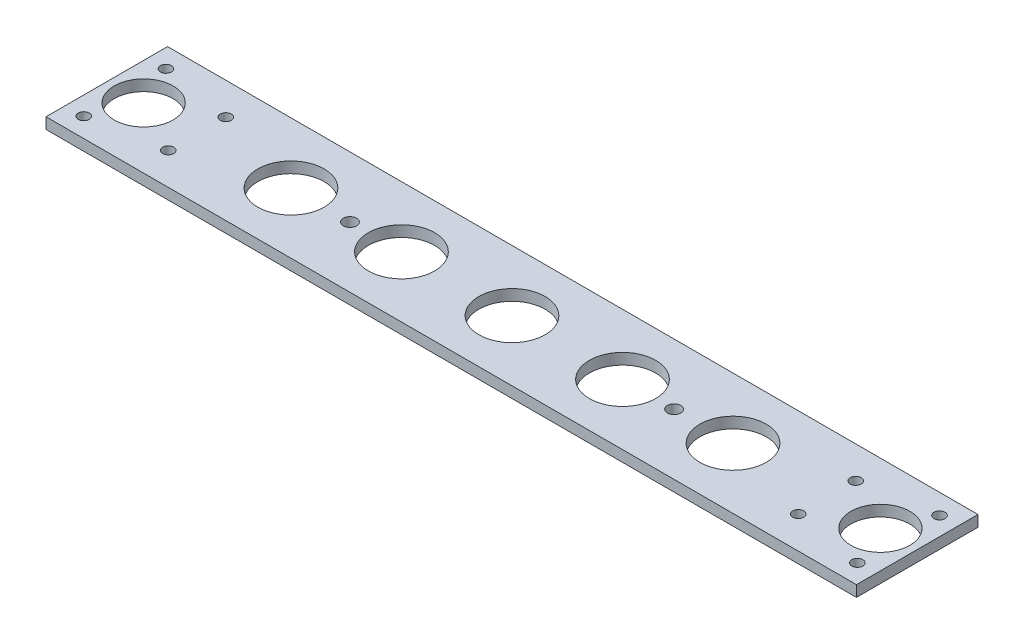
ISO-10303-21;
HEADER;
FILE_DESCRIPTION(('STEP AP214'),'2;1');
FILE_NAME('part.step','',(''),(''),'','','');
FILE_SCHEMA(('AUTOMOTIVE_DESIGN { 1 0 10303 214 1 1 1 1 }'));
ENDSEC;
DATA;
#1=APPLICATION_CONTEXT('core data for automotive mechanical design processes');
#2=APPLICATION_PROTOCOL_DEFINITION('international standard','automotive_design',2000,#1);
#3=PRODUCT_CONTEXT('',#1,'mechanical');
#4=PRODUCT('Part','Part','',(#3));
#5=PRODUCT_RELATED_PRODUCT_CATEGORY('part','',(#4));
#6=PRODUCT_DEFINITION_FORMATION('','',#4);
#7=PRODUCT_DEFINITION_CONTEXT('part definition',#1,'design');
#8=PRODUCT_DEFINITION('design','',#6,#7);
#9=PRODUCT_DEFINITION_SHAPE('','',#8);
#10=(LENGTH_UNIT() NAMED_UNIT(*) SI_UNIT(.MILLI.,.METRE.));
#11=(NAMED_UNIT(*) PLANE_ANGLE_UNIT() SI_UNIT($,.RADIAN.));
#12=(NAMED_UNIT(*) SI_UNIT($,.STERADIAN.) SOLID_ANGLE_UNIT());
#13=UNCERTAINTY_MEASURE_WITH_UNIT(LENGTH_MEASURE(1.E-05),#10,'distance_accuracy_value','');
#14=(GEOMETRIC_REPRESENTATION_CONTEXT(3) GLOBAL_UNCERTAINTY_ASSIGNED_CONTEXT((#13)) GLOBAL_UNIT_ASSIGNED_CONTEXT((#10,
#11,#12)) REPRESENTATION_CONTEXT('',''));
#15=CARTESIAN_POINT('',(0.,0.,0.));
#16=DIRECTION('',(0.,0.,1.));
#17=DIRECTION('',(1.,0.,0.));
#18=AXIS2_PLACEMENT_3D('',#15,#16,#17);
#19=CARTESIAN_POINT('',(0.,3.,0.));
#20=DIRECTION('',(0.,1.,0.));
#21=DIRECTION('',(0.,0.,1.));
#22=AXIS2_PLACEMENT_3D('',#19,#20,#21);
#23=PLANE('',#22);
#24=CARTESIAN_POINT('',(50.,3.,16.5));
#25=DIRECTION('',(0.,1.,0.));
#26=DIRECTION('',(0.,0.,1.));
#27=AXIS2_PLACEMENT_3D('',#24,#25,#26);
#28=CIRCLE('',#27,9.);
#29=CARTESIAN_POINT('',(50.,3.,25.5));
#30=VERTEX_POINT('',#29);
#31=EDGE_CURVE('E200',#30,#30,#28,.T.);
#32=ORIENTED_EDGE('',*,*,#31,.F.);
#33=EDGE_LOOP('',(#32));
#34=FACE_BOUND('',#33,.T.);
#35=CARTESIAN_POINT('',(170.,3.,16.5));
#36=DIRECTION('',(0.,1.,0.));
#37=DIRECTION('',(0.,0.,1.));
#38=AXIS2_PLACEMENT_3D('',#35,#36,#37);
#39=CIRCLE('',#38,9.00000000000001);
#40=CARTESIAN_POINT('',(170.,3.,25.5));
#41=VERTEX_POINT('',#40);
#42=EDGE_CURVE('E188',#41,#41,#39,.T.);
#43=ORIENTED_EDGE('',*,*,#42,.F.);
#44=EDGE_LOOP('',(#43));
#45=FACE_BOUND('',#44,.T.);
#46=CARTESIAN_POINT('',(210.,3.,16.5));
#47=DIRECTION('',(0.,1.,0.));
#48=DIRECTION('',(0.,0.,1.));
#49=AXIS2_PLACEMENT_3D('',#46,#47,#48);
#50=CIRCLE('',#49,8.00000000000001);
#51=CARTESIAN_POINT('',(210.,3.,24.5));
#52=VERTEX_POINT('',#51);
#53=EDGE_CURVE('E176',#52,#52,#50,.T.);
#54=ORIENTED_EDGE('',*,*,#53,.F.);
#55=EDGE_LOOP('',(#54));
#56=FACE_BOUND('',#55,.T.);
#57=CARTESIAN_POINT('',(140.,3.,16.5));
#58=DIRECTION('',(0.,1.,0.));
#59=DIRECTION('',(0.,0.,1.));
#60=AXIS2_PLACEMENT_3D('',#57,#58,#59);
#61=CIRCLE('',#60,9.00000000000001);
#62=CARTESIAN_POINT('',(140.,3.,25.5));
#63=VERTEX_POINT('',#62);
#64=EDGE_CURVE('E164',#63,#63,#61,.T.);
#65=ORIENTED_EDGE('',*,*,#64,.F.);
#66=EDGE_LOOP('',(#65));
#67=FACE_BOUND('',#66,.T.);
#68=CARTESIAN_POINT('',(215.,3.,27.75));
#69=DIRECTION('',(0.,1.,0.));
#70=DIRECTION('',(0.,0.,1.));
#71=AXIS2_PLACEMENT_3D('',#68,#69,#70);
#72=CIRCLE('',#71,1.5);
#73=CARTESIAN_POINT('',(215.,3.,29.25));
#74=VERTEX_POINT('',#73);
#75=EDGE_CURVE('E152',#74,#74,#72,.T.);
#76=ORIENTED_EDGE('',*,*,#75,.F.);
#77=EDGE_LOOP('',(#76));
#78=FACE_BOUND('',#77,.T.);
#79=CARTESIAN_POINT('',(195.5,3.,8.7));
#80=DIRECTION('',(0.,1.,0.));
#81=DIRECTION('',(0.,0.,1.));
#82=AXIS2_PLACEMENT_3D('',#79,#80,#81);
#83=CIRCLE('',#82,1.5);
#84=CARTESIAN_POINT('',(195.5,3.,10.2));
#85=VERTEX_POINT('',#84);
#86=EDGE_CURVE('E140',#85,#85,#83,.T.);
#87=ORIENTED_EDGE('',*,*,#86,.F.);
#88=EDGE_LOOP('',(#87));
#89=FACE_BOUND('',#88,.T.);
#90=CARTESIAN_POINT('',(24.5,3.,24.3));
#91=DIRECTION('',(0.,1.,0.));
#92=DIRECTION('',(0.,0.,1.));
#93=AXIS2_PLACEMENT_3D('',#90,#91,#92);
#94=CIRCLE('',#93,1.5);
#95=CARTESIAN_POINT('',(24.5,3.,25.8));
#96=VERTEX_POINT('',#95);
#97=EDGE_CURVE('E128',#96,#96,#94,.T.);
#98=ORIENTED_EDGE('',*,*,#97,.F.);
#99=EDGE_LOOP('',(#98));
#100=FACE_BOUND('',#99,.T.);
#101=CARTESIAN_POINT('',(5.,3.,5.45));
#102=DIRECTION('',(0.,1.,0.));
#103=DIRECTION('',(0.,0.,1.));
#104=AXIS2_PLACEMENT_3D('',#101,#102,#103);
#105=CIRCLE('',#104,1.5);
#106=CARTESIAN_POINT('',(5.,3.,6.95));
#107=VERTEX_POINT('',#106);
#108=EDGE_CURVE('E116',#107,#107,#105,.T.);
#109=ORIENTED_EDGE('',*,*,#108,.F.);
#110=EDGE_LOOP('',(#109));
#111=FACE_BOUND('',#110,.T.);
#112=DIRECTION('',(0.,0.,1.));
#113=VECTOR('',#112,1.);
#114=CARTESIAN_POINT('',(0.,3.,0.));
#115=LINE('',#114,#113);
#116=CARTESIAN_POINT('',(0.,3.,0.));
#117=VERTEX_POINT('',#116);
#118=CARTESIAN_POINT('',(0.,3.,33.));
#119=VERTEX_POINT('',#118);
#120=EDGE_CURVE('E86',#117,#119,#115,.T.);
#121=ORIENTED_EDGE('',*,*,#120,.T.);
#122=DIRECTION('',(1.,0.,0.));
#123=VECTOR('',#122,1.);
#124=CARTESIAN_POINT('',(0.,3.,33.));
#125=LINE('',#124,#123);
#126=CARTESIAN_POINT('',(220.,3.,33.));
#127=VERTEX_POINT('',#126);
#128=EDGE_CURVE('E81',#119,#127,#125,.T.);
#129=ORIENTED_EDGE('',*,*,#128,.T.);
#130=DIRECTION('',(0.,0.,-1.));
#131=VECTOR('',#130,1.);
#132=CARTESIAN_POINT('',(220.,3.,0.));
#133=LINE('',#132,#131);
#134=CARTESIAN_POINT('',(220.,3.,0.));
#135=VERTEX_POINT('',#134);
#136=EDGE_CURVE('E84',#127,#135,#133,.T.);
#137=ORIENTED_EDGE('',*,*,#136,.T.);
#138=DIRECTION('',(-1.,0.,0.));
#139=VECTOR('',#138,1.);
#140=CARTESIAN_POINT('',(0.,3.,0.));
#141=LINE('',#140,#139);
#142=EDGE_CURVE('E51',#135,#117,#141,.T.);
#143=ORIENTED_EDGE('',*,*,#142,.T.);
#144=EDGE_LOOP('',(#121,#129,#137,#143));
#145=FACE_BOUND('',#144,.T.);
#146=CARTESIAN_POINT('',(5.,3.,27.75));
#147=DIRECTION('',(0.,1.,0.));
#148=DIRECTION('',(0.,0.,1.));
#149=AXIS2_PLACEMENT_3D('',#146,#147,#148);
#150=CIRCLE('',#149,1.5);
#151=CARTESIAN_POINT('',(5.,3.,29.25));
#152=VERTEX_POINT('',#151);
#153=EDGE_CURVE('E101',#152,#152,#150,.T.);
#154=ORIENTED_EDGE('',*,*,#153,.F.);
#155=EDGE_LOOP('',(#154));
#156=FACE_BOUND('',#155,.T.);
#157=CARTESIAN_POINT('',(24.5,3.,8.7));
#158=DIRECTION('',(0.,1.,0.));
#159=DIRECTION('',(0.,0.,1.));
#160=AXIS2_PLACEMENT_3D('',#157,#158,#159);
#161=CIRCLE('',#160,1.5);
#162=CARTESIAN_POINT('',(24.5,3.,10.2));
#163=VERTEX_POINT('',#162);
#164=EDGE_CURVE('E122',#163,#163,#161,.T.);
#165=ORIENTED_EDGE('',*,*,#164,.F.);
#166=EDGE_LOOP('',(#165));
#167=FACE_BOUND('',#166,.T.);
#168=CARTESIAN_POINT('',(110.,3.,16.5));
#169=DIRECTION('',(0.,1.,0.));
#170=DIRECTION('',(0.,0.,1.));
#171=AXIS2_PLACEMENT_3D('',#168,#169,#170);
#172=CIRCLE('',#171,9.);
#173=CARTESIAN_POINT('',(110.,3.,25.5));
#174=VERTEX_POINT('',#173);
#175=EDGE_CURVE('E134',#174,#174,#172,.T.);
#176=ORIENTED_EDGE('',*,*,#175,.F.);
#177=EDGE_LOOP('',(#176));
#178=FACE_BOUND('',#177,.T.);
#179=CARTESIAN_POINT('',(195.5,3.,24.3));
#180=DIRECTION('',(0.,1.,0.));
#181=DIRECTION('',(0.,0.,1.));
#182=AXIS2_PLACEMENT_3D('',#179,#180,#181);
#183=CIRCLE('',#182,1.5);
#184=CARTESIAN_POINT('',(195.5,3.,25.8));
#185=VERTEX_POINT('',#184);
#186=EDGE_CURVE('E146',#185,#185,#183,.T.);
#187=ORIENTED_EDGE('',*,*,#186,.F.);
#188=EDGE_LOOP('',(#187));
#189=FACE_BOUND('',#188,.T.);
#190=CARTESIAN_POINT('',(215.,3.,5.45));
#191=DIRECTION('',(0.,1.,0.));
#192=DIRECTION('',(0.,0.,1.));
#193=AXIS2_PLACEMENT_3D('',#190,#191,#192);
#194=CIRCLE('',#193,1.5);
#195=CARTESIAN_POINT('',(215.,3.,6.95));
#196=VERTEX_POINT('',#195);
#197=EDGE_CURVE('E158',#196,#196,#194,.T.);
#198=ORIENTED_EDGE('',*,*,#197,.F.);
#199=EDGE_LOOP('',(#198));
#200=FACE_BOUND('',#199,.T.);
#201=CARTESIAN_POINT('',(10.,3.,16.5));
#202=DIRECTION('',(0.,1.,0.));
#203=DIRECTION('',(0.,0.,1.));
#204=AXIS2_PLACEMENT_3D('',#201,#202,#203);
#205=CIRCLE('',#204,8.);
#206=CARTESIAN_POINT('',(10.,3.,24.5));
#207=VERTEX_POINT('',#206);
#208=EDGE_CURVE('E170',#207,#207,#205,.T.);
#209=ORIENTED_EDGE('',*,*,#208,.F.);
#210=EDGE_LOOP('',(#209));
#211=FACE_BOUND('',#210,.T.);
#212=CARTESIAN_POINT('',(154.,3.,16.5));
#213=DIRECTION('',(0.,1.,0.));
#214=DIRECTION('',(0.,0.,1.));
#215=AXIS2_PLACEMENT_3D('',#212,#213,#214);
#216=CIRCLE('',#215,1.80000000000001);
#217=CARTESIAN_POINT('',(154.,3.,18.3));
#218=VERTEX_POINT('',#217);
#219=EDGE_CURVE('E182',#218,#218,#216,.T.);
#220=ORIENTED_EDGE('',*,*,#219,.F.);
#221=EDGE_LOOP('',(#220));
#222=FACE_BOUND('',#221,.T.);
#223=CARTESIAN_POINT('',(80.,3.,16.5));
#224=DIRECTION('',(0.,1.,0.));
#225=DIRECTION('',(0.,0.,1.));
#226=AXIS2_PLACEMENT_3D('',#223,#224,#225);
#227=CIRCLE('',#226,9.);
#228=CARTESIAN_POINT('',(80.,3.,25.5));
#229=VERTEX_POINT('',#228);
#230=EDGE_CURVE('E194',#229,#229,#227,.T.);
#231=ORIENTED_EDGE('',*,*,#230,.F.);
#232=EDGE_LOOP('',(#231));
#233=FACE_BOUND('',#232,.T.);
#234=CARTESIAN_POINT('',(66.,3.,16.5));
#235=DIRECTION('',(0.,1.,0.));
#236=DIRECTION('',(0.,0.,1.));
#237=AXIS2_PLACEMENT_3D('',#234,#235,#236);
#238=CIRCLE('',#237,1.79999999999999);
#239=CARTESIAN_POINT('',(66.,3.,18.3));
#240=VERTEX_POINT('',#239);
#241=EDGE_CURVE('E206',#240,#240,#238,.T.);
#242=ORIENTED_EDGE('',*,*,#241,.F.);
#243=EDGE_LOOP('',(#242));
#244=FACE_BOUND('',#243,.T.);
#245=ADVANCED_FACE('F34',(#34,#45,#56,#67,#78,#89,#100,#111,#145,#156,#167,#178,#189,#200,#211,
#222,#233,#244),#23,.T.);
#246=CARTESIAN_POINT('',(0.,0.,0.));
#247=DIRECTION('',(0.,1.,0.));
#248=DIRECTION('',(0.,0.,1.));
#249=AXIS2_PLACEMENT_3D('',#246,#247,#248);
#250=PLANE('',#249);
#251=DIRECTION('',(0.,0.,1.));
#252=VECTOR('',#251,1.);
#253=CARTESIAN_POINT('',(0.,0.,0.));
#254=LINE('',#253,#252);
#255=CARTESIAN_POINT('',(0.,0.,0.));
#256=VERTEX_POINT('',#255);
#257=CARTESIAN_POINT('',(0.,0.,33.));
#258=VERTEX_POINT('',#257);
#259=EDGE_CURVE('E98',#256,#258,#254,.T.);
#260=ORIENTED_EDGE('',*,*,#259,.F.);
#261=DIRECTION('',(-1.,0.,0.));
#262=VECTOR('',#261,1.);
#263=CARTESIAN_POINT('',(0.,0.,0.));
#264=LINE('',#263,#262);
#265=CARTESIAN_POINT('',(220.,0.,0.));
#266=VERTEX_POINT('',#265);
#267=EDGE_CURVE('E74',#266,#256,#264,.T.);
#268=ORIENTED_EDGE('',*,*,#267,.F.);
#269=DIRECTION('',(0.,0.,-1.));
#270=VECTOR('',#269,1.);
#271=CARTESIAN_POINT('',(220.,0.,0.));
#272=LINE('',#271,#270);
#273=CARTESIAN_POINT('',(220.,0.,33.));
#274=VERTEX_POINT('',#273);
#275=EDGE_CURVE('E68',#274,#266,#272,.T.);
#276=ORIENTED_EDGE('',*,*,#275,.F.);
#277=DIRECTION('',(1.,0.,0.));
#278=VECTOR('',#277,1.);
#279=CARTESIAN_POINT('',(0.,0.,33.));
#280=LINE('',#279,#278);
#281=EDGE_CURVE('E90',#258,#274,#280,.T.);
#282=ORIENTED_EDGE('',*,*,#281,.F.);
#283=EDGE_LOOP('',(#260,#268,#276,#282));
#284=FACE_BOUND('',#283,.T.);
#285=CARTESIAN_POINT('',(5.,0.,27.75));
#286=DIRECTION('',(0.,1.,0.));
#287=DIRECTION('',(0.,0.,1.));
#288=AXIS2_PLACEMENT_3D('',#285,#286,#287);
#289=CIRCLE('',#288,1.5);
#290=CARTESIAN_POINT('',(5.,0.,29.25));
#291=VERTEX_POINT('',#290);
#292=EDGE_CURVE('E113',#291,#291,#289,.T.);
#293=ORIENTED_EDGE('',*,*,#292,.T.);
#294=EDGE_LOOP('',(#293));
#295=FACE_BOUND('',#294,.T.);
#296=CARTESIAN_POINT('',(5.,0.,5.45));
#297=DIRECTION('',(0.,1.,0.));
#298=DIRECTION('',(0.,0.,1.));
#299=AXIS2_PLACEMENT_3D('',#296,#297,#298);
#300=CIRCLE('',#299,1.5);
#301=CARTESIAN_POINT('',(5.,0.,6.95));
#302=VERTEX_POINT('',#301);
#303=EDGE_CURVE('E119',#302,#302,#300,.T.);
#304=ORIENTED_EDGE('',*,*,#303,.T.);
#305=EDGE_LOOP('',(#304));
#306=FACE_BOUND('',#305,.T.);
#307=CARTESIAN_POINT('',(24.5,0.,8.7));
#308=DIRECTION('',(0.,1.,0.));
#309=DIRECTION('',(0.,0.,1.));
#310=AXIS2_PLACEMENT_3D('',#307,#308,#309);
#311=CIRCLE('',#310,1.5);
#312=CARTESIAN_POINT('',(24.5,0.,10.2));
#313=VERTEX_POINT('',#312);
#314=EDGE_CURVE('E125',#313,#313,#311,.T.);
#315=ORIENTED_EDGE('',*,*,#314,.T.);
#316=EDGE_LOOP('',(#315));
#317=FACE_BOUND('',#316,.T.);
#318=CARTESIAN_POINT('',(24.5,0.,24.3));
#319=DIRECTION('',(0.,1.,0.));
#320=DIRECTION('',(0.,0.,1.));
#321=AXIS2_PLACEMENT_3D('',#318,#319,#320);
#322=CIRCLE('',#321,1.5);
#323=CARTESIAN_POINT('',(24.5,0.,25.8));
#324=VERTEX_POINT('',#323);
#325=EDGE_CURVE('E131',#324,#324,#322,.T.);
#326=ORIENTED_EDGE('',*,*,#325,.T.);
#327=EDGE_LOOP('',(#326));
#328=FACE_BOUND('',#327,.T.);
#329=CARTESIAN_POINT('',(110.,0.,16.5));
#330=DIRECTION('',(0.,1.,0.));
#331=DIRECTION('',(0.,0.,1.));
#332=AXIS2_PLACEMENT_3D('',#329,#330,#331);
#333=CIRCLE('',#332,9.);
#334=CARTESIAN_POINT('',(110.,0.,25.5));
#335=VERTEX_POINT('',#334);
#336=EDGE_CURVE('E137',#335,#335,#333,.T.);
#337=ORIENTED_EDGE('',*,*,#336,.T.);
#338=EDGE_LOOP('',(#337));
#339=FACE_BOUND('',#338,.T.);
#340=CARTESIAN_POINT('',(195.5,0.,8.7));
#341=DIRECTION('',(0.,1.,0.));
#342=DIRECTION('',(0.,0.,1.));
#343=AXIS2_PLACEMENT_3D('',#340,#341,#342);
#344=CIRCLE('',#343,1.5);
#345=CARTESIAN_POINT('',(195.5,0.,10.2));
#346=VERTEX_POINT('',#345);
#347=EDGE_CURVE('E143',#346,#346,#344,.T.);
#348=ORIENTED_EDGE('',*,*,#347,.T.);
#349=EDGE_LOOP('',(#348));
#350=FACE_BOUND('',#349,.T.);
#351=CARTESIAN_POINT('',(195.5,0.,24.3));
#352=DIRECTION('',(0.,1.,0.));
#353=DIRECTION('',(0.,0.,1.));
#354=AXIS2_PLACEMENT_3D('',#351,#352,#353);
#355=CIRCLE('',#354,1.5);
#356=CARTESIAN_POINT('',(195.5,0.,25.8));
#357=VERTEX_POINT('',#356);
#358=EDGE_CURVE('E149',#357,#357,#355,.T.);
#359=ORIENTED_EDGE('',*,*,#358,.T.);
#360=EDGE_LOOP('',(#359));
#361=FACE_BOUND('',#360,.T.);
#362=CARTESIAN_POINT('',(215.,0.,27.75));
#363=DIRECTION('',(0.,1.,0.));
#364=DIRECTION('',(0.,0.,1.));
#365=AXIS2_PLACEMENT_3D('',#362,#363,#364);
#366=CIRCLE('',#365,1.5);
#367=CARTESIAN_POINT('',(215.,0.,29.25));
#368=VERTEX_POINT('',#367);
#369=EDGE_CURVE('E155',#368,#368,#366,.T.);
#370=ORIENTED_EDGE('',*,*,#369,.T.);
#371=EDGE_LOOP('',(#370));
#372=FACE_BOUND('',#371,.T.);
#373=CARTESIAN_POINT('',(215.,0.,5.45));
#374=DIRECTION('',(0.,1.,0.));
#375=DIRECTION('',(0.,0.,1.));
#376=AXIS2_PLACEMENT_3D('',#373,#374,#375);
#377=CIRCLE('',#376,1.5);
#378=CARTESIAN_POINT('',(215.,0.,6.95));
#379=VERTEX_POINT('',#378);
#380=EDGE_CURVE('E161',#379,#379,#377,.T.);
#381=ORIENTED_EDGE('',*,*,#380,.T.);
#382=EDGE_LOOP('',(#381));
#383=FACE_BOUND('',#382,.T.);
#384=CARTESIAN_POINT('',(140.,0.,16.5));
#385=DIRECTION('',(0.,1.,0.));
#386=DIRECTION('',(0.,0.,1.));
#387=AXIS2_PLACEMENT_3D('',#384,#385,#386);
#388=CIRCLE('',#387,9.00000000000001);
#389=CARTESIAN_POINT('',(140.,0.,25.5));
#390=VERTEX_POINT('',#389);
#391=EDGE_CURVE('E167',#390,#390,#388,.T.);
#392=ORIENTED_EDGE('',*,*,#391,.T.);
#393=EDGE_LOOP('',(#392));
#394=FACE_BOUND('',#393,.T.);
#395=CARTESIAN_POINT('',(10.,0.,16.5));
#396=DIRECTION('',(0.,1.,0.));
#397=DIRECTION('',(0.,0.,1.));
#398=AXIS2_PLACEMENT_3D('',#395,#396,#397);
#399=CIRCLE('',#398,8.);
#400=CARTESIAN_POINT('',(10.,0.,24.5));
#401=VERTEX_POINT('',#400);
#402=EDGE_CURVE('E173',#401,#401,#399,.T.);
#403=ORIENTED_EDGE('',*,*,#402,.T.);
#404=EDGE_LOOP('',(#403));
#405=FACE_BOUND('',#404,.T.);
#406=CARTESIAN_POINT('',(210.,0.,16.5));
#407=DIRECTION('',(0.,1.,0.));
#408=DIRECTION('',(0.,0.,1.));
#409=AXIS2_PLACEMENT_3D('',#406,#407,#408);
#410=CIRCLE('',#409,8.00000000000001);
#411=CARTESIAN_POINT('',(210.,0.,24.5));
#412=VERTEX_POINT('',#411);
#413=EDGE_CURVE('E179',#412,#412,#410,.T.);
#414=ORIENTED_EDGE('',*,*,#413,.T.);
#415=EDGE_LOOP('',(#414));
#416=FACE_BOUND('',#415,.T.);
#417=CARTESIAN_POINT('',(154.,0.,16.5));
#418=DIRECTION('',(0.,1.,0.));
#419=DIRECTION('',(0.,0.,1.));
#420=AXIS2_PLACEMENT_3D('',#417,#418,#419);
#421=CIRCLE('',#420,1.80000000000001);
#422=CARTESIAN_POINT('',(154.,0.,18.3));
#423=VERTEX_POINT('',#422);
#424=EDGE_CURVE('E185',#423,#423,#421,.T.);
#425=ORIENTED_EDGE('',*,*,#424,.T.);
#426=EDGE_LOOP('',(#425));
#427=FACE_BOUND('',#426,.T.);
#428=CARTESIAN_POINT('',(170.,0.,16.5));
#429=DIRECTION('',(0.,1.,0.));
#430=DIRECTION('',(0.,0.,1.));
#431=AXIS2_PLACEMENT_3D('',#428,#429,#430);
#432=CIRCLE('',#431,9.00000000000001);
#433=CARTESIAN_POINT('',(170.,0.,25.5));
#434=VERTEX_POINT('',#433);
#435=EDGE_CURVE('E191',#434,#434,#432,.T.);
#436=ORIENTED_EDGE('',*,*,#435,.T.);
#437=EDGE_LOOP('',(#436));
#438=FACE_BOUND('',#437,.T.);
#439=CARTESIAN_POINT('',(80.,0.,16.5));
#440=DIRECTION('',(0.,1.,0.));
#441=DIRECTION('',(0.,0.,1.));
#442=AXIS2_PLACEMENT_3D('',#439,#440,#441);
#443=CIRCLE('',#442,9.);
#444=CARTESIAN_POINT('',(80.,0.,25.5));
#445=VERTEX_POINT('',#444);
#446=EDGE_CURVE('E197',#445,#445,#443,.T.);
#447=ORIENTED_EDGE('',*,*,#446,.T.);
#448=EDGE_LOOP('',(#447));
#449=FACE_BOUND('',#448,.T.);
#450=CARTESIAN_POINT('',(50.,0.,16.5));
#451=DIRECTION('',(0.,1.,0.));
#452=DIRECTION('',(0.,0.,1.));
#453=AXIS2_PLACEMENT_3D('',#450,#451,#452);
#454=CIRCLE('',#453,9.);
#455=CARTESIAN_POINT('',(50.,0.,25.5));
#456=VERTEX_POINT('',#455);
#457=EDGE_CURVE('E203',#456,#456,#454,.T.);
#458=ORIENTED_EDGE('',*,*,#457,.T.);
#459=EDGE_LOOP('',(#458));
#460=FACE_BOUND('',#459,.T.);
#461=CARTESIAN_POINT('',(66.,0.,16.5));
#462=DIRECTION('',(0.,1.,0.));
#463=DIRECTION('',(0.,0.,1.));
#464=AXIS2_PLACEMENT_3D('',#461,#462,#463);
#465=CIRCLE('',#464,1.79999999999999);
#466=CARTESIAN_POINT('',(66.,0.,18.3));
#467=VERTEX_POINT('',#466);
#468=EDGE_CURVE('E209',#467,#467,#465,.T.);
#469=ORIENTED_EDGE('',*,*,#468,.T.);
#470=EDGE_LOOP('',(#469));
#471=FACE_BOUND('',#470,.T.);
#472=ADVANCED_FACE('F109',(#284,#295,#306,#317,#328,#339,#350,#361,#372,#383,#394,#405,#416,
#427,#438,#449,#460,#471),#250,.F.);
#473=CARTESIAN_POINT('',(0.,3.,0.));
#474=DIRECTION('',(1.,0.,0.));
#475=DIRECTION('',(0.,0.,-1.));
#476=AXIS2_PLACEMENT_3D('',#473,#474,#475);
#477=PLANE('',#476);
#478=ORIENTED_EDGE('',*,*,#259,.T.);
#479=DIRECTION('',(0.,-1.,0.));
#480=VECTOR('',#479,1.);
#481=CARTESIAN_POINT('',(0.,3.,33.));
#482=LINE('',#481,#480);
#483=EDGE_CURVE('E11',#119,#258,#482,.T.);
#484=ORIENTED_EDGE('',*,*,#483,.F.);
#485=ORIENTED_EDGE('',*,*,#120,.F.);
#486=DIRECTION('',(0.,-1.,0.));
#487=VECTOR('',#486,1.);
#488=CARTESIAN_POINT('',(0.,3.,0.));
#489=LINE('',#488,#487);
#490=EDGE_CURVE('E94',#117,#256,#489,.T.);
#491=ORIENTED_EDGE('',*,*,#490,.T.);
#492=EDGE_LOOP('',(#478,#484,#485,#491));
#493=FACE_BOUND('',#492,.T.);
#494=ADVANCED_FACE('F36',(#493),#477,.F.);
#495=CARTESIAN_POINT('',(0.,3.,33.));
#496=DIRECTION('',(0.,0.,-1.));
#497=DIRECTION('',(-1.,0.,0.));
#498=AXIS2_PLACEMENT_3D('',#495,#496,#497);
#499=PLANE('',#498);
#500=ORIENTED_EDGE('',*,*,#281,.T.);
#501=DIRECTION('',(0.,-1.,0.));
#502=VECTOR('',#501,1.);
#503=CARTESIAN_POINT('',(220.,3.,33.));
#504=LINE('',#503,#502);
#505=EDGE_CURVE('E43',#127,#274,#504,.T.);
#506=ORIENTED_EDGE('',*,*,#505,.F.);
#507=ORIENTED_EDGE('',*,*,#128,.F.);
#508=ORIENTED_EDGE('',*,*,#483,.T.);
#509=EDGE_LOOP('',(#500,#506,#507,#508));
#510=FACE_BOUND('',#509,.T.);
#511=ADVANCED_FACE('F89',(#510),#499,.F.);
#512=CARTESIAN_POINT('',(220.,3.,0.));
#513=DIRECTION('',(-1.,0.,0.));
#514=DIRECTION('',(0.,0.,1.));
#515=AXIS2_PLACEMENT_3D('',#512,#513,#514);
#516=PLANE('',#515);
#517=ORIENTED_EDGE('',*,*,#275,.T.);
#518=DIRECTION('',(0.,-1.,0.));
#519=VECTOR('',#518,1.);
#520=CARTESIAN_POINT('',(220.,3.,0.));
#521=LINE('',#520,#519);
#522=EDGE_CURVE('E91',#135,#266,#521,.T.);
#523=ORIENTED_EDGE('',*,*,#522,.F.);
#524=ORIENTED_EDGE('',*,*,#136,.F.);
#525=ORIENTED_EDGE('',*,*,#505,.T.);
#526=EDGE_LOOP('',(#517,#523,#524,#525));
#527=FACE_BOUND('',#526,.T.);
#528=ADVANCED_FACE('F92',(#527),#516,.F.);
#529=CARTESIAN_POINT('',(0.,3.,0.));
#530=DIRECTION('',(0.,0.,1.));
#531=DIRECTION('',(1.,0.,0.));
#532=AXIS2_PLACEMENT_3D('',#529,#530,#531);
#533=PLANE('',#532);
#534=ORIENTED_EDGE('',*,*,#267,.T.);
#535=ORIENTED_EDGE('',*,*,#490,.F.);
#536=ORIENTED_EDGE('',*,*,#142,.F.);
#537=ORIENTED_EDGE('',*,*,#522,.T.);
#538=EDGE_LOOP('',(#534,#535,#536,#537));
#539=FACE_BOUND('',#538,.T.);
#540=ADVANCED_FACE('F106',(#539),#533,.F.);
#541=CARTESIAN_POINT('',(5.,3.,27.75));
#542=DIRECTION('',(0.,-1.,0.));
#543=DIRECTION('',(0.,0.,-1.));
#544=AXIS2_PLACEMENT_3D('',#541,#542,#543);
#545=CYLINDRICAL_SURFACE('',#544,1.5);
#546=ORIENTED_EDGE('',*,*,#153,.T.);
#547=EDGE_LOOP('',(#546));
#548=FACE_BOUND('',#547,.T.);
#549=ORIENTED_EDGE('',*,*,#292,.F.);
#550=EDGE_LOOP('',(#549));
#551=FACE_BOUND('',#550,.T.);
#552=ADVANCED_FACE('F228',(#548,#551),#545,.F.);
#553=CARTESIAN_POINT('',(5.,3.,5.45));
#554=DIRECTION('',(0.,-1.,0.));
#555=DIRECTION('',(0.,0.,-1.));
#556=AXIS2_PLACEMENT_3D('',#553,#554,#555);
#557=CYLINDRICAL_SURFACE('',#556,1.5);
#558=ORIENTED_EDGE('',*,*,#108,.T.);
#559=EDGE_LOOP('',(#558));
#560=FACE_BOUND('',#559,.T.);
#561=ORIENTED_EDGE('',*,*,#303,.F.);
#562=EDGE_LOOP('',(#561));
#563=FACE_BOUND('',#562,.T.);
#564=ADVANCED_FACE('F274',(#560,#563),#557,.F.);
#565=CARTESIAN_POINT('',(24.5,3.,8.7));
#566=DIRECTION('',(0.,-1.,0.));
#567=DIRECTION('',(0.,0.,-1.));
#568=AXIS2_PLACEMENT_3D('',#565,#566,#567);
#569=CYLINDRICAL_SURFACE('',#568,1.5);
#570=ORIENTED_EDGE('',*,*,#164,.T.);
#571=EDGE_LOOP('',(#570));
#572=FACE_BOUND('',#571,.T.);
#573=ORIENTED_EDGE('',*,*,#314,.F.);
#574=EDGE_LOOP('',(#573));
#575=FACE_BOUND('',#574,.T.);
#576=ADVANCED_FACE('F282',(#572,#575),#569,.F.);
#577=CARTESIAN_POINT('',(24.5,3.,24.3));
#578=DIRECTION('',(0.,-1.,0.));
#579=DIRECTION('',(0.,0.,-1.));
#580=AXIS2_PLACEMENT_3D('',#577,#578,#579);
#581=CYLINDRICAL_SURFACE('',#580,1.5);
#582=ORIENTED_EDGE('',*,*,#97,.T.);
#583=EDGE_LOOP('',(#582));
#584=FACE_BOUND('',#583,.T.);
#585=ORIENTED_EDGE('',*,*,#325,.F.);
#586=EDGE_LOOP('',(#585));
#587=FACE_BOUND('',#586,.T.);
#588=ADVANCED_FACE('F290',(#584,#587),#581,.F.);
#589=CARTESIAN_POINT('',(110.,3.,16.5));
#590=DIRECTION('',(0.,-1.,0.));
#591=DIRECTION('',(0.,0.,-1.));
#592=AXIS2_PLACEMENT_3D('',#589,#590,#591);
#593=CYLINDRICAL_SURFACE('',#592,9.);
#594=ORIENTED_EDGE('',*,*,#175,.T.);
#595=EDGE_LOOP('',(#594));
#596=FACE_BOUND('',#595,.T.);
#597=ORIENTED_EDGE('',*,*,#336,.F.);
#598=EDGE_LOOP('',(#597));
#599=FACE_BOUND('',#598,.T.);
#600=ADVANCED_FACE('F299',(#596,#599),#593,.F.);
#601=CARTESIAN_POINT('',(195.5,3.,8.7));
#602=DIRECTION('',(0.,-1.,0.));
#603=DIRECTION('',(0.,0.,-1.));
#604=AXIS2_PLACEMENT_3D('',#601,#602,#603);
#605=CYLINDRICAL_SURFACE('',#604,1.5);
#606=ORIENTED_EDGE('',*,*,#86,.T.);
#607=EDGE_LOOP('',(#606));
#608=FACE_BOUND('',#607,.T.);
#609=ORIENTED_EDGE('',*,*,#347,.F.);
#610=EDGE_LOOP('',(#609));
#611=FACE_BOUND('',#610,.T.);
#612=ADVANCED_FACE('F308',(#608,#611),#605,.F.);
#613=CARTESIAN_POINT('',(195.5,3.,24.3));
#614=DIRECTION('',(0.,-1.,0.));
#615=DIRECTION('',(0.,0.,-1.));
#616=AXIS2_PLACEMENT_3D('',#613,#614,#615);
#617=CYLINDRICAL_SURFACE('',#616,1.5);
#618=ORIENTED_EDGE('',*,*,#186,.T.);
#619=EDGE_LOOP('',(#618));
#620=FACE_BOUND('',#619,.T.);
#621=ORIENTED_EDGE('',*,*,#358,.F.);
#622=EDGE_LOOP('',(#621));
#623=FACE_BOUND('',#622,.T.);
#624=ADVANCED_FACE('F317',(#620,#623),#617,.F.);
#625=CARTESIAN_POINT('',(215.,3.,27.75));
#626=DIRECTION('',(0.,-1.,0.));
#627=DIRECTION('',(0.,0.,-1.));
#628=AXIS2_PLACEMENT_3D('',#625,#626,#627);
#629=CYLINDRICAL_SURFACE('',#628,1.5);
#630=ORIENTED_EDGE('',*,*,#75,.T.);
#631=EDGE_LOOP('',(#630));
#632=FACE_BOUND('',#631,.T.);
#633=ORIENTED_EDGE('',*,*,#369,.F.);
#634=EDGE_LOOP('',(#633));
#635=FACE_BOUND('',#634,.T.);
#636=ADVANCED_FACE('F326',(#632,#635),#629,.F.);
#637=CARTESIAN_POINT('',(215.,3.,5.45));
#638=DIRECTION('',(0.,-1.,0.));
#639=DIRECTION('',(0.,0.,-1.));
#640=AXIS2_PLACEMENT_3D('',#637,#638,#639);
#641=CYLINDRICAL_SURFACE('',#640,1.5);
#642=ORIENTED_EDGE('',*,*,#197,.T.);
#643=EDGE_LOOP('',(#642));
#644=FACE_BOUND('',#643,.T.);
#645=ORIENTED_EDGE('',*,*,#380,.F.);
#646=EDGE_LOOP('',(#645));
#647=FACE_BOUND('',#646,.T.);
#648=ADVANCED_FACE('F335',(#644,#647),#641,.F.);
#649=CARTESIAN_POINT('',(140.,3.,16.5));
#650=DIRECTION('',(0.,-1.,0.));
#651=DIRECTION('',(0.,0.,-1.));
#652=AXIS2_PLACEMENT_3D('',#649,#650,#651);
#653=CYLINDRICAL_SURFACE('',#652,9.00000000000001);
#654=ORIENTED_EDGE('',*,*,#64,.T.);
#655=EDGE_LOOP('',(#654));
#656=FACE_BOUND('',#655,.T.);
#657=ORIENTED_EDGE('',*,*,#391,.F.);
#658=EDGE_LOOP('',(#657));
#659=FACE_BOUND('',#658,.T.);
#660=ADVANCED_FACE('F344',(#656,#659),#653,.F.);
#661=CARTESIAN_POINT('',(10.,3.,16.5));
#662=DIRECTION('',(0.,-1.,0.));
#663=DIRECTION('',(0.,0.,-1.));
#664=AXIS2_PLACEMENT_3D('',#661,#662,#663);
#665=CYLINDRICAL_SURFACE('',#664,8.);
#666=ORIENTED_EDGE('',*,*,#208,.T.);
#667=EDGE_LOOP('',(#666));
#668=FACE_BOUND('',#667,.T.);
#669=ORIENTED_EDGE('',*,*,#402,.F.);
#670=EDGE_LOOP('',(#669));
#671=FACE_BOUND('',#670,.T.);
#672=ADVANCED_FACE('F353',(#668,#671),#665,.F.);
#673=CARTESIAN_POINT('',(210.,3.,16.5));
#674=DIRECTION('',(0.,-1.,0.));
#675=DIRECTION('',(0.,0.,-1.));
#676=AXIS2_PLACEMENT_3D('',#673,#674,#675);
#677=CYLINDRICAL_SURFACE('',#676,8.00000000000001);
#678=ORIENTED_EDGE('',*,*,#53,.T.);
#679=EDGE_LOOP('',(#678));
#680=FACE_BOUND('',#679,.T.);
#681=ORIENTED_EDGE('',*,*,#413,.F.);
#682=EDGE_LOOP('',(#681));
#683=FACE_BOUND('',#682,.T.);
#684=ADVANCED_FACE('F362',(#680,#683),#677,.F.);
#685=CARTESIAN_POINT('',(154.,3.,16.5));
#686=DIRECTION('',(0.,-1.,0.));
#687=DIRECTION('',(0.,0.,-1.));
#688=AXIS2_PLACEMENT_3D('',#685,#686,#687);
#689=CYLINDRICAL_SURFACE('',#688,1.80000000000001);
#690=ORIENTED_EDGE('',*,*,#219,.T.);
#691=EDGE_LOOP('',(#690));
#692=FACE_BOUND('',#691,.T.);
#693=ORIENTED_EDGE('',*,*,#424,.F.);
#694=EDGE_LOOP('',(#693));
#695=FACE_BOUND('',#694,.T.);
#696=ADVANCED_FACE('F371',(#692,#695),#689,.F.);
#697=CARTESIAN_POINT('',(170.,3.,16.5));
#698=DIRECTION('',(0.,-1.,0.));
#699=DIRECTION('',(0.,0.,-1.));
#700=AXIS2_PLACEMENT_3D('',#697,#698,#699);
#701=CYLINDRICAL_SURFACE('',#700,9.00000000000001);
#702=ORIENTED_EDGE('',*,*,#42,.T.);
#703=EDGE_LOOP('',(#702));
#704=FACE_BOUND('',#703,.T.);
#705=ORIENTED_EDGE('',*,*,#435,.F.);
#706=EDGE_LOOP('',(#705));
#707=FACE_BOUND('',#706,.T.);
#708=ADVANCED_FACE('F380',(#704,#707),#701,.F.);
#709=CARTESIAN_POINT('',(80.,3.,16.5));
#710=DIRECTION('',(0.,-1.,0.));
#711=DIRECTION('',(0.,0.,-1.));
#712=AXIS2_PLACEMENT_3D('',#709,#710,#711);
#713=CYLINDRICAL_SURFACE('',#712,9.);
#714=ORIENTED_EDGE('',*,*,#230,.T.);
#715=EDGE_LOOP('',(#714));
#716=FACE_BOUND('',#715,.T.);
#717=ORIENTED_EDGE('',*,*,#446,.F.);
#718=EDGE_LOOP('',(#717));
#719=FACE_BOUND('',#718,.T.);
#720=ADVANCED_FACE('F389',(#716,#719),#713,.F.);
#721=CARTESIAN_POINT('',(50.,3.,16.5));
#722=DIRECTION('',(0.,-1.,0.));
#723=DIRECTION('',(0.,0.,-1.));
#724=AXIS2_PLACEMENT_3D('',#721,#722,#723);
#725=CYLINDRICAL_SURFACE('',#724,9.);
#726=ORIENTED_EDGE('',*,*,#31,.T.);
#727=EDGE_LOOP('',(#726));
#728=FACE_BOUND('',#727,.T.);
#729=ORIENTED_EDGE('',*,*,#457,.F.);
#730=EDGE_LOOP('',(#729));
#731=FACE_BOUND('',#730,.T.);
#732=ADVANCED_FACE('F398',(#728,#731),#725,.F.);
#733=CARTESIAN_POINT('',(66.,3.,16.5));
#734=DIRECTION('',(0.,-1.,0.));
#735=DIRECTION('',(0.,0.,-1.));
#736=AXIS2_PLACEMENT_3D('',#733,#734,#735);
#737=CYLINDRICAL_SURFACE('',#736,1.79999999999999);
#738=ORIENTED_EDGE('',*,*,#241,.T.);
#739=EDGE_LOOP('',(#738));
#740=FACE_BOUND('',#739,.T.);
#741=ORIENTED_EDGE('',*,*,#468,.F.);
#742=EDGE_LOOP('',(#741));
#743=FACE_BOUND('',#742,.T.);
#744=ADVANCED_FACE('F215',(#740,#743),#737,.F.);
#745=CLOSED_SHELL('',(#245,#472,#494,#511,#528,#540,#552,#564,#576,#588,#600,#612,#624,#636,
#648,#660,#672,#684,#696,#708,#720,#732,#744));
#746=MANIFOLD_SOLID_BREP('B2',#745);
#747=ADVANCED_BREP_SHAPE_REPRESENTATION('',(#18,#746),#14);
#748=SHAPE_DEFINITION_REPRESENTATION(#9,#747);
ENDSEC;
END-ISO-10303-21;
